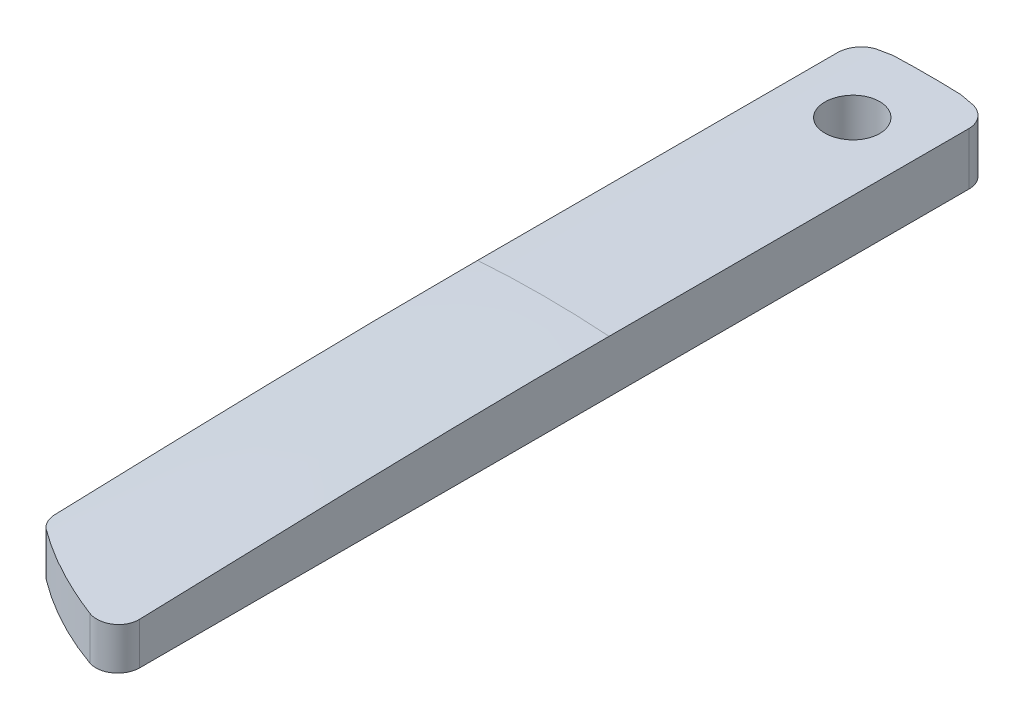
ISO-10303-21;
HEADER;
FILE_DESCRIPTION(('STEP AP214'),'2;1');
FILE_NAME('part.step','',(''),(''),'','','');
FILE_SCHEMA(('AUTOMOTIVE_DESIGN { 1 0 10303 214 1 1 1 1 }'));
ENDSEC;
DATA;
#1=APPLICATION_CONTEXT('core data for automotive mechanical design processes');
#2=APPLICATION_PROTOCOL_DEFINITION('international standard','automotive_design',2000,#1);
#3=PRODUCT_CONTEXT('',#1,'mechanical');
#4=PRODUCT('Part','Part','',(#3));
#5=PRODUCT_RELATED_PRODUCT_CATEGORY('part','',(#4));
#6=PRODUCT_DEFINITION_FORMATION('','',#4);
#7=PRODUCT_DEFINITION_CONTEXT('part definition',#1,'design');
#8=PRODUCT_DEFINITION('design','',#6,#7);
#9=PRODUCT_DEFINITION_SHAPE('','',#8);
#10=(LENGTH_UNIT() NAMED_UNIT(*) SI_UNIT(.MILLI.,.METRE.));
#11=(NAMED_UNIT(*) PLANE_ANGLE_UNIT() SI_UNIT($,.RADIAN.));
#12=(NAMED_UNIT(*) SI_UNIT($,.STERADIAN.) SOLID_ANGLE_UNIT());
#13=UNCERTAINTY_MEASURE_WITH_UNIT(LENGTH_MEASURE(1.E-05),#10,'distance_accuracy_value','');
#14=(GEOMETRIC_REPRESENTATION_CONTEXT(3) GLOBAL_UNCERTAINTY_ASSIGNED_CONTEXT((#13)) GLOBAL_UNIT_ASSIGNED_CONTEXT((#10,
#11,#12)) REPRESENTATION_CONTEXT('',''));
#15=CARTESIAN_POINT('',(0.,0.,0.));
#16=DIRECTION('',(0.,0.,1.));
#17=DIRECTION('',(1.,0.,0.));
#18=AXIS2_PLACEMENT_3D('',#15,#16,#17);
#19=CARTESIAN_POINT('',(13.9928553197694,-2.5,24.7449671614379));
#20=DIRECTION('',(0.,-1.,0.));
#21=DIRECTION('',(0.,0.,-1.));
#22=AXIS2_PLACEMENT_3D('',#19,#20,#21);
#23=PLANE('',#22);
#24=CARTESIAN_POINT('',(0.,-2.5,-18.));
#25=DIRECTION('',(0.,1.,0.));
#26=DIRECTION('',(0.,0.,1.));
#27=AXIS2_PLACEMENT_3D('',#24,#25,#26);
#28=CIRCLE('',#27,2.5);
#29=CARTESIAN_POINT('',(0.,-2.5,-15.5));
#30=VERTEX_POINT('',#29);
#31=EDGE_CURVE('E404',#30,#30,#28,.T.);
#32=ORIENTED_EDGE('',*,*,#31,.T.);
#33=EDGE_LOOP('',(#32));
#34=FACE_BOUND('',#33,.T.);
#35=CARTESIAN_POINT('',(0.,-2.5,0.));
#36=DIRECTION('',(0.,1.,0.));
#37=DIRECTION('',(0.,0.,-1.));
#38=AXIS2_PLACEMENT_3D('',#35,#36,#37);
#39=CIRCLE('',#38,25.);
#40=CARTESIAN_POINT('',(-3.08027292062684,-2.5,-24.8095126662023));
#41=VERTEX_POINT('',#40);
#42=CARTESIAN_POINT('',(-4.34782608695653,-2.5,-24.6190253324046));
#43=VERTEX_POINT('',#42);
#44=EDGE_CURVE('E140',#41,#43,#39,.T.);
#45=ORIENTED_EDGE('',*,*,#44,.F.);
#46=DIRECTION('',(1.,0.,0.));
#47=VECTOR('',#46,1.);
#48=CARTESIAN_POINT('',(13.9928553197694,-2.5,-24.8095126662023));
#49=LINE('',#48,#47);
#50=CARTESIAN_POINT('',(3.08027292062684,-2.5,-24.8095126662023));
#51=VERTEX_POINT('',#50);
#52=EDGE_CURVE('E337',#41,#51,#49,.T.);
#53=ORIENTED_EDGE('',*,*,#52,.T.);
#54=CARTESIAN_POINT('',(4.34782608695653,-2.5,-24.6190253324046));
#55=VERTEX_POINT('',#54);
#56=EDGE_CURVE('E378',#55,#51,#39,.T.);
#57=ORIENTED_EDGE('',*,*,#56,.F.);
#58=CARTESIAN_POINT('',(4.00000000000001,-2.5,-22.6495033058122));
#59=DIRECTION('',(0.,-1.,0.));
#60=DIRECTION('',(0.,0.,-1.));
#61=AXIS2_PLACEMENT_3D('',#58,#59,#60);
#62=CIRCLE('',#61,2.);
#63=CARTESIAN_POINT('',(6.00000000000001,-2.5,-22.6495033058122));
#64=VERTEX_POINT('',#63);
#65=EDGE_CURVE('E376',#55,#64,#62,.T.);
#66=ORIENTED_EDGE('',*,*,#65,.T.);
#67=DIRECTION('',(0.,0.,-1.));
#68=VECTOR('',#67,1.);
#69=CARTESIAN_POINT('',(6.00000000000001,-2.5,-24.2693221990232));
#70=LINE('',#69,#68);
#71=CARTESIAN_POINT('',(6.00000000000002,-2.5,53.0317634197305));
#72=VERTEX_POINT('',#71);
#73=EDGE_CURVE('E369',#72,#64,#70,.T.);
#74=ORIENTED_EDGE('',*,*,#73,.F.);
#75=CARTESIAN_POINT('',(4.00000000000001,-2.5,53.0317634197305));
#76=DIRECTION('',(0.,-1.,0.));
#77=DIRECTION('',(0.,0.,-1.));
#78=AXIS2_PLACEMENT_3D('',#75,#76,#77);
#79=CIRCLE('',#78,2.);
#80=CARTESIAN_POINT('',(3.33380964534872,-2.5,54.91754983695));
#81=VERTEX_POINT('',#80);
#82=EDGE_CURVE('E389',#72,#81,#79,.T.);
#83=ORIENTED_EDGE('',*,*,#82,.T.);
#84=CARTESIAN_POINT('',(13.9928553197694,-2.5,24.7449671614379));
#85=DIRECTION('',(0.,1.,0.));
#86=DIRECTION('',(0.,0.,-1.));
#87=AXIS2_PLACEMENT_3D('',#84,#85,#86);
#88=CIRCLE('',#87,32.);
#89=CARTESIAN_POINT('',(-5.19952368798464,-2.5,50.3506811335716));
#90=VERTEX_POINT('',#89);
#91=EDGE_CURVE('E399',#90,#81,#88,.T.);
#92=ORIENTED_EDGE('',*,*,#91,.F.);
#93=CARTESIAN_POINT('',(-4.00000000000001,-2.5,48.7503240103132));
#94=DIRECTION('',(0.,-1.,0.));
#95=DIRECTION('',(0.,0.,-1.));
#96=AXIS2_PLACEMENT_3D('',#93,#94,#95);
#97=CIRCLE('',#96,2.);
#98=CARTESIAN_POINT('',(-6.00000000000001,-2.5,48.7503240103132));
#99=VERTEX_POINT('',#98);
#100=EDGE_CURVE('E386',#90,#99,#97,.T.);
#101=ORIENTED_EDGE('',*,*,#100,.T.);
#102=DIRECTION('',(0.,0.,1.));
#103=VECTOR('',#102,1.);
#104=CARTESIAN_POINT('',(-6.00000000000001,-2.5,49.7306778009768));
#105=LINE('',#104,#103);
#106=CARTESIAN_POINT('',(-6.00000000000001,-2.5,-22.6495033058122));
#107=VERTEX_POINT('',#106);
#108=EDGE_CURVE('E372',#107,#99,#105,.T.);
#109=ORIENTED_EDGE('',*,*,#108,.F.);
#110=CARTESIAN_POINT('',(-4.00000000000001,-2.5,-22.6495033058122));
#111=DIRECTION('',(0.,-1.,0.));
#112=DIRECTION('',(0.,0.,-1.));
#113=AXIS2_PLACEMENT_3D('',#110,#111,#112);
#114=CIRCLE('',#113,2.);
#115=EDGE_CURVE('E342',#107,#43,#114,.T.);
#116=ORIENTED_EDGE('',*,*,#115,.T.);
#117=EDGE_LOOP('',(#45,#53,#57,#66,#74,#83,#92,#101,#109,#116));
#118=FACE_BOUND('',#117,.T.);
#119=ADVANCED_FACE('F115',(#34,#118),#23,.T.);
#120=CARTESIAN_POINT('',(13.9928553197694,2.5,24.7449671614379));
#121=DIRECTION('',(0.,-1.,0.));
#122=DIRECTION('',(0.,0.,-1.));
#123=AXIS2_PLACEMENT_3D('',#120,#121,#122);
#124=CYLINDRICAL_SURFACE('',#123,32.);
#125=CARTESIAN_POINT('',(-5.19952368798462,1.48592776477285,50.3506811335716));
#126=CARTESIAN_POINT('',(-4.98227051781722,1.49420419211207,50.5135210941134));
#127=CARTESIAN_POINT('',(-4.76292823961869,1.50185639134832,50.6736064220553));
#128=CARTESIAN_POINT('',(-4.32095768664768,1.51579098201104,50.9876323832612));
#129=CARTESIAN_POINT('',(-4.09834297108921,1.52207790122318,51.141591900073));
#130=CARTESIAN_POINT('',(-3.649861191794,1.53320258146359,51.4434206638506));
#131=CARTESIAN_POINT('',(-3.42400455101821,1.53804421534596,51.5913052543202));
#132=CARTESIAN_POINT('',(-2.96906614109376,1.54619966728101,51.8810280006863));
#133=CARTESIAN_POINT('',(-2.73999189077253,1.54951658179831,52.022877875401));
#134=CARTESIAN_POINT('',(-2.2786378228024,1.55454363433481,52.3005637034983));
#135=CARTESIAN_POINT('',(-2.04636283920938,1.55625597261258,52.4364076480232));
#136=CARTESIAN_POINT('',(-1.57861969865163,1.55799450810096,52.7021032683411));
#137=CARTESIAN_POINT('',(-1.34315389648187,1.55802188752692,52.831959081654));
#138=CARTESIAN_POINT('',(-0.869015475376385,1.55631031749254,53.0856993032242));
#139=CARTESIAN_POINT('',(-0.630342674966581,1.55457126765654,53.2095833717238));
#140=CARTESIAN_POINT('',(-0.149804906372357,1.54924542676444,53.4513698405769));
#141=CARTESIAN_POINT('',(0.0920621032840678,1.54565739216592,53.5692681564908));
#142=CARTESIAN_POINT('',(0.578992188593072,1.5365510570891,53.7990692953596));
#143=CARTESIAN_POINT('',(0.824059144358763,1.53103015258742,53.9109637940654));
#144=CARTESIAN_POINT('',(1.3173982733493,1.51797415891296,54.1287320632589));
#145=CARTESIAN_POINT('',(1.56567596298336,1.51043498591371,54.2345930927424));
#146=CARTESIAN_POINT('',(2.06545131683964,1.49325638977009,54.4402571286103));
#147=CARTESIAN_POINT('',(2.31695593097059,1.48361127833727,54.5400427728287));
#148=CARTESIAN_POINT('',(2.82320454402427,1.46213410990519,54.733508358399));
#149=CARTESIAN_POINT('',(3.07795671591359,1.45029463595169,54.8271660896906));
#150=CARTESIAN_POINT('',(3.33380964534873,1.43734147897503,54.91754983695));
#151=B_SPLINE_CURVE_WITH_KNOTS('',3,(#125,#126,#127,#128,#129,#130,#131,#132,#133,#134,#135,
#136,#137,#138,#139,#140,#141,#142,#143,#144,#145,#146,#147,#148,#149,#150),.UNSPECIFIED.,.F.,
.F.,(4,2,2,2,2,2,2,2,2,2,2,2,4),(0.,0.814875929795815,1.62700669287661,2.43694128340289,
3.24522367757474,4.0523960939944,4.85900216868354,5.6656540805538,6.47284921896487,
7.2811360477051,8.09107091533176,8.90322115111113,9.71816824681233),.UNSPECIFIED.);
#152=CARTESIAN_POINT('',(-5.19952368798462,1.48592776477285,50.3506811335716));
#153=VERTEX_POINT('',#152);
#154=CARTESIAN_POINT('',(3.33380964534872,1.43734147897503,54.91754983695));
#155=VERTEX_POINT('',#154);
#156=EDGE_CURVE('E228',#153,#155,#151,.T.);
#157=ORIENTED_EDGE('',*,*,#156,.F.);
#158=DIRECTION('',(0.,-1.,0.));
#159=VECTOR('',#158,1.);
#160=CARTESIAN_POINT('',(-5.19952368798464,2.5,50.3506811335716));
#161=LINE('',#160,#159);
#162=EDGE_CURVE('E352',#153,#90,#161,.T.);
#163=ORIENTED_EDGE('',*,*,#162,.T.);
#164=ORIENTED_EDGE('',*,*,#91,.T.);
#165=DIRECTION('',(0.,-1.,0.));
#166=VECTOR('',#165,1.);
#167=CARTESIAN_POINT('',(3.33380964534872,2.5,54.91754983695));
#168=LINE('',#167,#166);
#169=EDGE_CURVE('E345',#81,#155,#168,.F.);
#170=ORIENTED_EDGE('',*,*,#169,.T.);
#171=EDGE_LOOP('',(#157,#163,#164,#170));
#172=FACE_BOUND('',#171,.T.);
#173=ADVANCED_FACE('F397',(#172),#124,.T.);
#174=CARTESIAN_POINT('',(6.00000000000001,2.5,-24.2693221990232));
#175=DIRECTION('',(-1.,0.,0.));
#176=DIRECTION('',(0.,0.,1.));
#177=AXIS2_PLACEMENT_3D('',#174,#175,#176);
#178=PLANE('',#177);
#179=DIRECTION('',(0.,0.,-1.));
#180=VECTOR('',#179,1.);
#181=CARTESIAN_POINT('',(6.00000000000002,2.28797084492587,77.3564966406965));
#182=LINE('',#181,#180);
#183=CARTESIAN_POINT('',(6.00000000000001,2.28797084492587,10.1904873337977));
#184=VERTEX_POINT('',#183);
#185=CARTESIAN_POINT('',(6.00000000000001,2.28797084492587,-22.6495033058122));
#186=VERTEX_POINT('',#185);
#187=EDGE_CURVE('E132',#184,#186,#182,.T.);
#188=ORIENTED_EDGE('',*,*,#187,.F.);
#189=CARTESIAN_POINT('',(6.00000000000002,1.3477578727449,53.0317634197305));
#190=CARTESIAN_POINT('',(6.00000000000002,1.40900490410655,51.0802190646011));
#191=CARTESIAN_POINT('',(6.00000000000002,1.47149210443265,49.1287131995284));
#192=CARTESIAN_POINT('',(6.00000000000001,1.59577490113629,45.2256392920489));
#193=CARTESIAN_POINT('',(6.00000000000001,1.65757048320436,43.2740712491903));
#194=CARTESIAN_POINT('',(6.00000000000001,1.7772955082444,39.370807952014));
#195=CARTESIAN_POINT('',(6.00000000000001,1.83522493839082,37.4191126972956));
#196=CARTESIAN_POINT('',(6.00000000000001,1.94404164442152,33.5155505512585));
#197=CARTESIAN_POINT('',(6.00000000000001,1.99492902437227,31.5636836629027));
#198=CARTESIAN_POINT('',(6.00000000000001,2.07885573629368,27.9936038691958));
#199=CARTESIAN_POINT('',(6.00000000000001,2.1134591097672,26.3754281885269));
#200=CARTESIAN_POINT('',(6.00000000000001,2.17429199556667,23.1389213554166));
#201=CARTESIAN_POINT('',(6.00000000000001,2.20052152986356,21.5205902033942));
#202=CARTESIAN_POINT('',(6.00000000000001,2.24328988823328,18.2836780170968));
#203=CARTESIAN_POINT('',(6.00000000000001,2.25982800161605,16.6650969732003));
#204=CARTESIAN_POINT('',(6.00000000000001,2.28219025088088,13.4278421537915));
#205=CARTESIAN_POINT('',(6.00000000000001,2.28801425539474,11.8091683773856));
#206=CARTESIAN_POINT('',(6.00000000000001,2.28797084492587,10.1904873337977));
#207=B_SPLINE_CURVE_WITH_KNOTS('',3,(#189,#190,#191,#192,#193,#194,#195,#196,#197,#198,#199,
#200,#201,#202,#203,#204,#205,#206),.UNSPECIFIED.,.F.,.F.,(4,2,2,2,2,2,2,2,4),(0.,
5.85751692583066,11.7151548194537,17.5728121442129,23.4303828960557,28.2860018463583,
33.1416080565867,37.9975702929786,42.8535920690688),.UNSPECIFIED.);
#208=CARTESIAN_POINT('',(6.00000000000001,1.3477578727449,53.0317634197305));
#209=VERTEX_POINT('',#208);
#210=EDGE_CURVE('E217',#209,#184,#207,.T.);
#211=ORIENTED_EDGE('',*,*,#210,.F.);
#212=DIRECTION('',(0.,-1.,0.));
#213=VECTOR('',#212,1.);
#214=CARTESIAN_POINT('',(6.00000000000002,2.5,53.0317634197305));
#215=LINE('',#214,#213);
#216=EDGE_CURVE('E371',#209,#72,#215,.T.);
#217=ORIENTED_EDGE('',*,*,#216,.T.);
#218=ORIENTED_EDGE('',*,*,#73,.T.);
#219=DIRECTION('',(0.,-1.,0.));
#220=VECTOR('',#219,1.);
#221=CARTESIAN_POINT('',(6.00000000000001,2.5,-22.6495033058122));
#222=LINE('',#221,#220);
#223=EDGE_CURVE('E364',#64,#186,#222,.F.);
#224=ORIENTED_EDGE('',*,*,#223,.T.);
#225=EDGE_LOOP('',(#188,#211,#217,#218,#224));
#226=FACE_BOUND('',#225,.T.);
#227=ADVANCED_FACE('F292',(#226),#178,.F.);
#228=CARTESIAN_POINT('',(0.,2.5,0.));
#229=DIRECTION('',(0.,-1.,0.));
#230=DIRECTION('',(0.,0.,-1.));
#231=AXIS2_PLACEMENT_3D('',#228,#229,#230);
#232=CYLINDRICAL_SURFACE('',#231,25.);
#233=DIRECTION('',(0.,-1.,0.));
#234=VECTOR('',#233,1.);
#235=CARTESIAN_POINT('',(3.08027292062684,2.5,-24.8095126662023));
#236=LINE('',#235,#234);
#237=CARTESIAN_POINT('',(3.08027292062691,2.44416942165279,-24.8095126662023));
#238=VERTEX_POINT('',#237);
#239=EDGE_CURVE('E51',#238,#51,#236,.T.);
#240=ORIENTED_EDGE('',*,*,#239,.F.);
#241=CARTESIAN_POINT('',(4.34782608695652,2.38872957181996,-24.6190253324046));
#242=CARTESIAN_POINT('',(4.1374471613898,2.39951078603454,-24.6561799795087));
#243=CARTESIAN_POINT('',(3.92662826807895,2.4095213806279,-24.6906312475438));
#244=CARTESIAN_POINT('',(3.50411054596908,2.42800133057218,-24.7541270254764));
#245=CARTESIAN_POINT('',(3.29241171717006,2.4364706859231,-24.7831715353738));
#246=CARTESIAN_POINT('',(3.08027292062691,2.4441694216528,-24.8095126662023));
#247=B_SPLINE_CURVE_WITH_KNOTS('',3,(#241,#242,#243,#244,#245,#246),.UNSPECIFIED.,.F.,.F.,(4,2,
4),(0.,0.64154919441254,1.28309838882483),.UNSPECIFIED.);
#248=CARTESIAN_POINT('',(4.34782608695653,2.38872957181996,-24.6190253324046));
#249=VERTEX_POINT('',#248);
#250=EDGE_CURVE('E219',#249,#238,#247,.T.);
#251=ORIENTED_EDGE('',*,*,#250,.F.);
#252=DIRECTION('',(0.,-1.,0.));
#253=VECTOR('',#252,1.);
#254=CARTESIAN_POINT('',(4.34782608695653,2.5,-24.6190253324046));
#255=LINE('',#254,#253);
#256=EDGE_CURVE('E349',#249,#55,#255,.T.);
#257=ORIENTED_EDGE('',*,*,#256,.T.);
#258=ORIENTED_EDGE('',*,*,#56,.T.);
#259=EDGE_LOOP('',(#240,#251,#257,#258));
#260=FACE_BOUND('',#259,.T.);
#261=ADVANCED_FACE('F287',(#260),#232,.T.);
#262=DIRECTION('',(0.,-1.,0.));
#263=VECTOR('',#262,1.);
#264=CARTESIAN_POINT('',(-3.08027292062684,2.5,-24.8095126662023));
#265=LINE('',#264,#263);
#266=CARTESIAN_POINT('',(-3.08027292062691,2.44416942165279,-24.8095126662023));
#267=VERTEX_POINT('',#266);
#268=EDGE_CURVE('E125',#41,#267,#265,.F.);
#269=ORIENTED_EDGE('',*,*,#268,.F.);
#270=ORIENTED_EDGE('',*,*,#44,.T.);
#271=DIRECTION('',(0.,-1.,0.));
#272=VECTOR('',#271,1.);
#273=CARTESIAN_POINT('',(-4.34782608695653,2.5,-24.6190253324046));
#274=LINE('',#273,#272);
#275=CARTESIAN_POINT('',(-4.34782608695653,2.38872957181996,-24.6190253324046));
#276=VERTEX_POINT('',#275);
#277=EDGE_CURVE('E339',#43,#276,#274,.F.);
#278=ORIENTED_EDGE('',*,*,#277,.T.);
#279=CARTESIAN_POINT('',(-3.08027292062691,2.44416942165279,-24.8095126662023));
#280=CARTESIAN_POINT('',(-3.29241171717006,2.43647068592309,-24.7831715353738));
#281=CARTESIAN_POINT('',(-3.50411054596909,2.42800133057217,-24.7541270254764));
#282=CARTESIAN_POINT('',(-3.92662826807896,2.40952138062789,-24.6906312475438));
#283=CARTESIAN_POINT('',(-4.13744716138981,2.39951078603453,-24.6561799795087));
#284=CARTESIAN_POINT('',(-4.34782608695652,2.38872957181995,-24.6190253324046));
#285=B_SPLINE_CURVE_WITH_KNOTS('',3,(#279,#280,#281,#282,#283,#284),.UNSPECIFIED.,.F.,.F.,(4,2,
4),(0.,0.641549194412296,1.28309838882484),.UNSPECIFIED.);
#286=EDGE_CURVE('E210',#267,#276,#285,.T.);
#287=ORIENTED_EDGE('',*,*,#286,.F.);
#288=EDGE_LOOP('',(#269,#270,#278,#287));
#289=FACE_BOUND('',#288,.T.);
#290=ADVANCED_FACE('F291',(#289),#232,.T.);
#291=CARTESIAN_POINT('',(-6.00000000000001,2.5,49.7306778009768));
#292=DIRECTION('',(1.,0.,0.));
#293=DIRECTION('',(0.,0.,-1.));
#294=AXIS2_PLACEMENT_3D('',#291,#292,#293);
#295=PLANE('',#294);
#296=DIRECTION('',(0.,0.,-1.));
#297=VECTOR('',#296,1.);
#298=CARTESIAN_POINT('',(-6.00000000000002,2.28797084492587,77.3564966406965));
#299=LINE('',#298,#297);
#300=CARTESIAN_POINT('',(-6.00000000000001,2.28797084492587,-22.6495033058122));
#301=VERTEX_POINT('',#300);
#302=CARTESIAN_POINT('',(-6.00000000000001,2.28797084492587,10.1904873337977));
#303=VERTEX_POINT('',#302);
#304=EDGE_CURVE('E199',#301,#303,#299,.F.);
#305=ORIENTED_EDGE('',*,*,#304,.F.);
#306=DIRECTION('',(0.,-1.,0.));
#307=VECTOR('',#306,1.);
#308=CARTESIAN_POINT('',(-6.00000000000001,2.5,-22.6495033058122));
#309=LINE('',#308,#307);
#310=EDGE_CURVE('E341',#301,#107,#309,.T.);
#311=ORIENTED_EDGE('',*,*,#310,.T.);
#312=ORIENTED_EDGE('',*,*,#108,.T.);
#313=DIRECTION('',(0.,-1.,0.));
#314=VECTOR('',#313,1.);
#315=CARTESIAN_POINT('',(-6.00000000000001,2.5,48.7503240103132));
#316=LINE('',#315,#314);
#317=CARTESIAN_POINT('',(-6.,1.48350172448284,48.7503240103132));
#318=VERTEX_POINT('',#317);
#319=EDGE_CURVE('E226',#99,#318,#316,.F.);
#320=ORIENTED_EDGE('',*,*,#319,.T.);
#321=CARTESIAN_POINT('',(-6.,2.28797084492587,10.1904873337977));
#322=CARTESIAN_POINT('',(-6.,2.28797507351094,11.166812280221));
#323=CARTESIAN_POINT('',(-6.00000000000001,2.28586672477483,12.1431356056413));
#324=CARTESIAN_POINT('',(-6.00000000000001,2.27761711552835,14.0957628937102));
#325=CARTESIAN_POINT('',(-6.00000000000002,2.27147586516508,15.0720668564012));
#326=CARTESIAN_POINT('',(-6.,2.24729170059607,18.0008611045771));
#327=CARTESIAN_POINT('',(-5.99999999999995,2.22348834494228,19.9533055389628));
#328=CARTESIAN_POINT('',(-5.99999999999994,2.16252073050069,23.8579593132316));
#329=CARTESIAN_POINT('',(-5.99999999999999,2.1253565998791,25.8101686551901));
#330=CARTESIAN_POINT('',(-6.00000000000003,2.04015728162102,29.7143803189646));
#331=CARTESIAN_POINT('',(-6.00000000000004,1.99212190437696,31.6663826365757));
#332=CARTESIAN_POINT('',(-6.00000000000003,1.87282820793208,36.1405828379366));
#333=CARTESIAN_POINT('',(-6.00000000000002,1.79888562610699,38.6627070753375));
#334=CARTESIAN_POINT('',(-6.,1.64442483175734,43.7066671755156));
#335=CARTESIAN_POINT('',(-5.99999999999999,1.56390685368271,46.228503045367));
#336=CARTESIAN_POINT('',(-5.99999999999997,1.48350172448284,48.7503240103132));
#337=B_SPLINE_CURVE_WITH_KNOTS('',3,(#321,#322,#323,#324,#325,#326,#327,#328,#329,#330,#331,
#332,#333,#334,#335,#336),.UNSPECIFIED.,.F.,.F.,(4,2,2,2,2,2,2,4),(0.,2.92896976753949,
5.85793216558603,11.715641601686,17.5732948479066,23.4310502664986,31.0006593767229,
38.5699987054566),.UNSPECIFIED.);
#338=EDGE_CURVE('E214',#303,#318,#337,.T.);
#339=ORIENTED_EDGE('',*,*,#338,.F.);
#340=EDGE_LOOP('',(#305,#311,#312,#320,#339));
#341=FACE_BOUND('',#340,.T.);
#342=ADVANCED_FACE('F223',(#341),#295,.F.);
#343=CARTESIAN_POINT('',(0.,2.5,-18.));
#344=DIRECTION('',(0.,-1.,0.));
#345=DIRECTION('',(0.,0.,-1.));
#346=AXIS2_PLACEMENT_3D('',#343,#344,#345);
#347=CYLINDRICAL_SURFACE('',#346,2.5);
#348=ORIENTED_EDGE('',*,*,#31,.F.);
#349=EDGE_LOOP('',(#348));
#350=FACE_BOUND('',#349,.T.);
#351=CARTESIAN_POINT('',(0.,2.5,-20.5));
#352=CARTESIAN_POINT('',(-0.140393524378718,2.4999995046087,-20.4999937841003));
#353=CARTESIAN_POINT('',(-0.280888074295992,2.49964843891319,-20.4881340996054));
#354=CARTESIAN_POINT('',(-0.558005647093424,2.49828171748725,-20.4409892913322));
#355=CARTESIAN_POINT('',(-0.694623840406101,2.4972652676845,-20.4056761773938));
#356=CARTESIAN_POINT('',(-0.95993400401729,2.49468288969539,-20.3126326671837));
#357=CARTESIAN_POINT('',(-1.08862981263495,2.49311723009836,-20.254913227187));
#358=CARTESIAN_POINT('',(-1.33446931951485,2.48961304149571,-20.1187111960275));
#359=CARTESIAN_POINT('',(-1.45161583025469,2.48767460360977,-20.0402336770882));
#360=CARTESIAN_POINT('',(-1.67111944140127,2.48364216613613,-19.8647022282896));
#361=CARTESIAN_POINT('',(-1.7734709848132,2.48154810854245,-19.7676413501677));
#362=CARTESIAN_POINT('',(-1.96043256823564,2.47744095729957,-19.5577103991347));
#363=CARTESIAN_POINT('',(-2.04504190204469,2.47542786687572,-19.444839697236));
#364=CARTESIAN_POINT('',(-2.19412564280933,2.47170938036892,-19.2064729073285));
#365=CARTESIAN_POINT('',(-2.25859676954662,2.47000403443212,-19.0809747668924));
#366=CARTESIAN_POINT('',(-2.3655526214457,2.46709386485658,-18.820930175471));
#367=CARTESIAN_POINT('',(-2.40803743309319,2.46588903924899,-18.6863837600806));
#368=CARTESIAN_POINT('',(-2.46980287379754,2.46411618035475,-18.4121033550716));
#369=CARTESIAN_POINT('',(-2.48909025786777,2.46354796169358,-18.2723708878379));
#370=CARTESIAN_POINT('',(-2.50393415065727,2.46311182801535,-17.9916504292447));
#371=CARTESIAN_POINT('',(-2.4994907520903,2.46324391026228,-17.8506624427926));
#372=CARTESIAN_POINT('',(-2.46700493241114,2.46419331109802,-17.5714789086865));
#373=CARTESIAN_POINT('',(-2.43896981673904,2.46501041756108,-17.43328251015));
#374=CARTESIAN_POINT('',(-2.36010767528186,2.46723742037347,-17.1635584733523));
#375=CARTESIAN_POINT('',(-2.30928060033578,2.4686473180014,-17.032030849476));
#376=CARTESIAN_POINT('',(-2.18626895522428,2.47190121055802,-16.7793544758949));
#377=CARTESIAN_POINT('',(-2.11408103649144,2.47374527353804,-16.658207357301));
#378=CARTESIAN_POINT('',(-1.95039935241673,2.47765954321457,-16.4297488298107));
#379=CARTESIAN_POINT('',(-1.85890554498097,2.47972975040414,-16.3224374510822));
#380=CARTESIAN_POINT('',(-1.65916792957406,2.48386387779281,-16.1246540178099));
#381=CARTESIAN_POINT('',(-1.55091778578673,2.48592779531143,-16.0341883615028));
#382=CARTESIAN_POINT('',(-1.32076268672099,2.4898159191187,-15.872713635295));
#383=CARTESIAN_POINT('',(-1.19885772924849,2.49164012536884,-15.8017045685205));
#384=CARTESIAN_POINT('',(-0.944849909762427,2.49484321244865,-15.6811594407829));
#385=CARTESIAN_POINT('',(-0.812746952496885,2.4962220891182,-15.6316235804136));
#386=CARTESIAN_POINT('',(-0.542094676929893,2.49837901386233,-15.5554350986089));
#387=CARTESIAN_POINT('',(-0.403545375506729,2.49915706350996,-15.5287824172627));
#388=CARTESIAN_POINT('',(-0.123988938954879,2.50002442732397,-15.4991247085231));
#389=CARTESIAN_POINT('',(0.0170172562401733,2.50011399932433,-15.4961108284216));
#390=CARTESIAN_POINT('',(0.297533629735388,2.49959499378029,-15.5137932065561));
#391=CARTESIAN_POINT('',(0.437043809699056,2.49898641701229,-15.5344894384247));
#392=CARTESIAN_POINT('',(0.710583265267391,2.49713986854047,-15.5989972206533));
#393=CARTESIAN_POINT('',(0.844613489435591,2.49590200626664,-15.6428047521094));
#394=CARTESIAN_POINT('',(1.10341750203545,2.49293637808399,-15.7522875119779));
#395=CARTESIAN_POINT('',(1.22819127264489,2.49120861123193,-15.8179627824926));
#396=CARTESIAN_POINT('',(1.46498123802067,2.48745717315988,-15.9693395272444));
#397=CARTESIAN_POINT('',(1.5769936224216,2.48543341397063,-16.0550469596066));
#398=CARTESIAN_POINT('',(1.7850429177898,2.48131836506353,-16.2440463538795));
#399=CARTESIAN_POINT('',(1.88107978927006,2.47922707517876,-16.3473383592531));
#400=CARTESIAN_POINT('',(2.05448146308617,2.47521198907129,-16.5686127386144));
#401=CARTESIAN_POINT('',(2.13184055281937,2.47328824420698,-16.6865995903403));
#402=CARTESIAN_POINT('',(2.26565165005375,2.46982595095152,-16.9338915683921));
#403=CARTESIAN_POINT('',(2.32210370368156,2.46828740171053,-17.0631966697462));
#404=CARTESIAN_POINT('',(2.41248825841416,2.46576933485917,-17.3294331323827));
#405=CARTESIAN_POINT('',(2.446424457618,2.46478972544987,-17.4663632372958));
#406=CARTESIAN_POINT('',(2.49082610452918,2.46349972900635,-17.7439805801934));
#407=CARTESIAN_POINT('',(2.50129157044439,2.46318934145297,-17.8846678152633));
#408=CARTESIAN_POINT('',(2.49845424187916,2.46327281736618,-18.1657486001041));
#409=CARTESIAN_POINT('',(2.4851604596561,2.4636664138006,-18.3061422410174));
#410=CARTESIAN_POINT('',(2.4352005252155,2.46511292567584,-18.582704077844));
#411=CARTESIAN_POINT('',(2.39853432663588,2.46616584242451,-18.7188722653749));
#412=CARTESIAN_POINT('',(2.30287157861963,2.46881225953516,-18.9831214226391));
#413=CARTESIAN_POINT('',(2.24387465356549,2.4704057689902,-19.1112022562955));
#414=CARTESIAN_POINT('',(2.10522837096703,2.47395366349274,-19.3556384118559));
#415=CARTESIAN_POINT('',(2.02557976276147,2.47590803544572,-19.4719941589876));
#416=CARTESIAN_POINT('',(1.84786492977961,2.47995807750223,-19.6897183857987));
#417=CARTESIAN_POINT('',(1.74979368738696,2.48205378600048,-19.7910827689327));
#418=CARTESIAN_POINT('',(1.53799721863,2.48615039038899,-19.9759360733266));
#419=CARTESIAN_POINT('',(1.42426812157842,2.48815126267041,-20.0594205615197));
#420=CARTESIAN_POINT('',(1.18434076631098,2.49183332276256,-20.2061579091563));
#421=CARTESIAN_POINT('',(1.05813455489749,2.49351430464529,-20.2693977539498));
#422=CARTESIAN_POINT('',(0.79698863765337,2.49636338844887,-20.3737173662836));
#423=CARTESIAN_POINT('',(0.662059564889552,2.49753210177965,-20.41482356455));
#424=CARTESIAN_POINT('',(0.438564897759313,2.49891253358713,-20.4628131108167));
#425=CARTESIAN_POINT('',(0.351450023475592,2.49931856455643,-20.4767406530866));
#426=CARTESIAN_POINT('',(0.176236704864157,2.49986245322686,-20.4953360475219));
#427=CARTESIAN_POINT('',(0.0881382608146911,2.50000031100386,-20.5000039023067));
#428=CARTESIAN_POINT('',(0.,2.5,-20.5));
#429=B_SPLINE_CURVE_WITH_KNOTS('',3,(#351,#352,#353,#354,#355,#356,#357,#358,#359,#360,#361,
#362,#363,#364,#365,#366,#367,#368,#369,#370,#371,#372,#373,#374,#375,#376,#377,#378,#379,#380,
#381,#382,#383,#384,#385,#386,#387,#388,#389,#390,#391,#392,#393,#394,#395,#396,#397,#398,#399,
#400,#401,#402,#403,#404,#405,#406,#407,#408,#409,#410,#411,#412,#413,#414,#415,#416,#417,#418,
#419,#420,#421,#422,#423,#424,#425,#426,#427,#428),.UNSPECIFIED.,.T.,.F.,(4,2,2,2,2,2,2,2,2,2,2,
2,2,2,2,2,2,2,2,2,2,2,2,2,2,2,2,2,2,2,2,2,2,2,2,2,2,2,4),(0.,0.420858857472668,
0.842220887644196,1.26337713865912,1.68443057532394,2.10564175114649,2.52686968945313,
2.94816620387193,3.36946106106012,3.79063320886891,4.21180371120218,4.63284384133271,
5.05388487962772,5.47499195613254,5.89609995081405,6.31736756330548,6.7386352434875,
7.15990685889558,7.58117737136181,8.00229011089399,8.42340238211803,8.8444414488,
9.26548132612255,9.68664659219761,10.1078128992605,10.529107857394,10.9504018860301,
11.3716267024146,11.792851192026,12.2139159384569,12.6349815201246,13.0560541847072,
13.4771115729601,13.8982838077482,14.3195603456484,14.7411071677547,15.1621494802117,
15.426362366124,15.6905751772936),.UNSPECIFIED.);
#430=CARTESIAN_POINT('',(0.,2.5,-20.5));
#431=VERTEX_POINT('',#430);
#432=EDGE_CURVE('E229',#431,#431,#429,.T.);
#433=ORIENTED_EDGE('',*,*,#432,.T.);
#434=EDGE_LOOP('',(#433));
#435=FACE_BOUND('',#434,.T.);
#436=ADVANCED_FACE('F265',(#350,#435),#347,.F.);
#437=CARTESIAN_POINT('',(4.00000000000001,2.5,53.0317634197305));
#438=DIRECTION('',(0.,-1.,0.));
#439=DIRECTION('',(0.,0.,-1.));
#440=AXIS2_PLACEMENT_3D('',#437,#438,#439);
#441=CYLINDRICAL_SURFACE('',#440,2.);
#442=ORIENTED_EDGE('',*,*,#169,.F.);
#443=ORIENTED_EDGE('',*,*,#82,.F.);
#444=ORIENTED_EDGE('',*,*,#216,.F.);
#445=CARTESIAN_POINT('',(6.00000000000001,1.3477578727449,53.0317634197305));
#446=CARTESIAN_POINT('',(5.999999686585,1.34599614550849,53.0878664103495));
#447=CARTESIAN_POINT('',(5.99763784221396,1.34440575725035,53.1439480470526));
#448=CARTESIAN_POINT('',(5.98821316547493,1.34157429289668,53.2557212387371));
#449=CARTESIAN_POINT('',(5.98115053720786,1.34033320163854,53.3114128105484));
#450=CARTESIAN_POINT('',(5.95297433945673,1.33714701589769,53.4772118325718));
#451=CARTESIAN_POINT('',(5.92487229160559,1.33573333626802,53.5862251773271));
#452=CARTESIAN_POINT('',(5.85080366841227,1.33431760155893,53.798010208616));
#453=CARTESIAN_POINT('',(5.80482849196076,1.33431622696826,53.9007788624342));
#454=CARTESIAN_POINT('',(5.69632652877211,1.33563820223227,54.0971506043256));
#455=CARTESIAN_POINT('',(5.63380324220748,1.33696127211163,54.1907556249152));
#456=CARTESIAN_POINT('',(5.49397690604917,1.34078694327021,54.3661607437921));
#457=CARTESIAN_POINT('',(5.41667298687943,1.34328961396055,54.4479601470326));
#458=CARTESIAN_POINT('',(5.24946825576611,1.34928698831077,54.5974605326529));
#459=CARTESIAN_POINT('',(5.15956516727802,1.35278187137088,54.6651589616183));
#460=CARTESIAN_POINT('',(4.969569224809,1.36055809867968,54.7846323055674));
#461=CARTESIAN_POINT('',(4.86946045303729,1.3648406801312,54.836381823326));
#462=CARTESIAN_POINT('',(4.66200750814274,1.37397132185773,54.9223589319939));
#463=CARTESIAN_POINT('',(4.55466349796965,1.3788193693993,54.9565869173686));
#464=CARTESIAN_POINT('',(4.33555458631634,1.38888586890287,55.006620913733));
#465=CARTESIAN_POINT('',(4.22378093849355,1.39410507168001,55.0223883874485));
#466=CARTESIAN_POINT('',(3.99919541863463,1.40472405159753,55.0349188110964));
#467=CARTESIAN_POINT('',(3.88638403266801,1.41012374703531,55.0316902470586));
#468=CARTESIAN_POINT('',(3.69955178885329,1.41918134014149,55.0105161899236));
#469=CARTESIAN_POINT('',(3.62490683142051,1.42283154469149,54.9977272024877));
#470=CARTESIAN_POINT('',(3.47764618750815,1.43010946585759,54.9638233545975));
#471=CARTESIAN_POINT('',(3.40502770612104,1.43373720746832,54.9427206369485));
#472=CARTESIAN_POINT('',(3.33380964534872,1.43734147897503,54.91754983695));
#473=B_SPLINE_CURVE_WITH_KNOTS('',3,(#445,#446,#447,#448,#449,#450,#451,#452,#453,#454,#455,
#456,#457,#458,#459,#460,#461,#462,#463,#464,#465,#466,#467,#468,#469,#470,#471,#472),
.UNSPECIFIED.,.F.,.F.,(4,2,2,2,2,2,2,2,2,2,2,2,2,4),(0.,0.168288818624853,0.336570330880705,
0.672595261837842,1.00878209908931,1.34489788455124,1.68103345050809,2.01722983131458,
2.3539588413484,2.69068027021035,3.02810337620481,3.3653757578692,3.59238326476375,
3.81906043269885),.UNSPECIFIED.);
#474=EDGE_CURVE('E234',#209,#155,#473,.T.);
#475=ORIENTED_EDGE('',*,*,#474,.T.);
#476=EDGE_LOOP('',(#442,#443,#444,#475));
#477=FACE_BOUND('',#476,.T.);
#478=ADVANCED_FACE('F315',(#477),#441,.T.);
#479=CARTESIAN_POINT('',(-4.00000000000001,2.5,48.7503240103132));
#480=DIRECTION('',(0.,-1.,0.));
#481=DIRECTION('',(0.,0.,-1.));
#482=AXIS2_PLACEMENT_3D('',#479,#480,#481);
#483=CYLINDRICAL_SURFACE('',#482,2.);
#484=ORIENTED_EDGE('',*,*,#162,.F.);
#485=CARTESIAN_POINT('',(-5.19952368798462,1.48592776477285,50.3506811335716));
#486=CARTESIAN_POINT('',(-5.24445710371962,1.48421617719543,50.3170013163484));
#487=CARTESIAN_POINT('',(-5.28795293695621,1.48261716669675,50.2814427779942));
#488=CARTESIAN_POINT('',(-5.37180629393392,1.47966817283832,50.2067930377447));
#489=CARTESIAN_POINT('',(-5.41216390090355,1.47831818287303,50.1677019295957));
#490=CARTESIAN_POINT('',(-5.52800452029855,1.4746816184286,50.0456049178229));
#491=CARTESIAN_POINT('',(-5.59841244990013,1.47280236959148,49.9576573338));
#492=CARTESIAN_POINT('',(-5.7235158663903,1.47030321248392,49.7711720759546));
#493=CARTESIAN_POINT('',(-5.77819864986387,1.46968431994008,49.6726259279801));
#494=CARTESIAN_POINT('',(-5.87024975677179,1.46982249716503,49.4677855659696));
#495=CARTESIAN_POINT('',(-5.90762915453067,1.47057868533792,49.3614963581235));
#496=CARTESIAN_POINT('',(-5.95711737429392,1.47315353153875,49.1708905304301));
#497=CARTESIAN_POINT('',(-5.97317362347758,1.47466652835962,49.0875699197401));
#498=CARTESIAN_POINT('',(-5.99462435066878,1.47848968313833,48.9196145982399));
#499=CARTESIAN_POINT('',(-6.00002243042304,1.48079957149018,48.8349803411017));
#500=CARTESIAN_POINT('',(-5.99999999999998,1.48350172448284,48.7503240103132));
#501=B_SPLINE_CURVE_WITH_KNOTS('',3,(#485,#486,#487,#488,#489,#490,#491,#492,#493,#494,#495,
#496,#497,#498,#499,#500),.UNSPECIFIED.,.F.,.F.,(4,2,2,2,2,2,2,4),(0.,0.168438525104794,
0.33687258154831,0.67315842894335,1.00971518347925,1.3460562398021,1.60000174165045,
1.85386141224638),.UNSPECIFIED.);
#502=EDGE_CURVE('E318',#153,#318,#501,.T.);
#503=ORIENTED_EDGE('',*,*,#502,.T.);
#504=ORIENTED_EDGE('',*,*,#319,.F.);
#505=ORIENTED_EDGE('',*,*,#100,.F.);
#506=EDGE_LOOP('',(#484,#503,#504,#505));
#507=FACE_BOUND('',#506,.T.);
#508=ADVANCED_FACE('F310',(#507),#483,.T.);
#509=CARTESIAN_POINT('',(-4.00000000000001,2.5,-22.6495033058122));
#510=DIRECTION('',(0.,-1.,0.));
#511=DIRECTION('',(0.,0.,-1.));
#512=AXIS2_PLACEMENT_3D('',#509,#510,#511);
#513=CYLINDRICAL_SURFACE('',#512,2.);
#514=ORIENTED_EDGE('',*,*,#310,.F.);
#515=CARTESIAN_POINT('',(-6.00000000000001,2.28797084492587,-22.6495033058122));
#516=CARTESIAN_POINT('',(-5.99999970126248,2.28797054377742,-22.7056775237485));
#517=CARTESIAN_POINT('',(-5.99763185224678,2.28813846241845,-22.7618247813395));
#518=CARTESIAN_POINT('',(-5.98818605171506,2.28880622399534,-22.87371657754));
#519=CARTESIAN_POINT('',(-5.98110835555056,2.28930604893638,-22.9294611378168));
#520=CARTESIAN_POINT('',(-5.95287817474218,2.29129448527179,-23.0953970873389));
#521=CARTESIAN_POINT('',(-5.92472841073842,2.29327208817011,-23.2044752831055));
#522=CARTESIAN_POINT('',(-5.85056199084549,2.2984215054221,-23.4163416034672));
#523=CARTESIAN_POINT('',(-5.80453704263484,2.30159387400842,-23.5191267830676));
#524=CARTESIAN_POINT('',(-5.69594954935063,2.30895653020663,-23.7154917795541));
#525=CARTESIAN_POINT('',(-5.63339180912948,2.31314652204254,-23.8090742601551));
#526=CARTESIAN_POINT('',(-5.4934370213372,2.32232641965221,-23.9845147793974));
#527=CARTESIAN_POINT('',(-5.41602333248177,2.32731722143728,-24.0663594882957));
#528=CARTESIAN_POINT('',(-5.24853561021382,2.33784473745614,-24.2159549587525));
#529=CARTESIAN_POINT('',(-5.15845314094893,2.34338181470299,-24.283696254005));
#530=CARTESIAN_POINT('',(-4.96795930783601,2.3547494979354,-24.4032847177363));
#531=CARTESIAN_POINT('',(-4.86751853120389,2.36058091435949,-24.4550848637238));
#532=CARTESIAN_POINT('',(-4.6595220877948,2.37225473440315,-24.5409674772869));
#533=CARTESIAN_POINT('',(-4.55198298389253,2.378097083554,-24.5750896534282));
#534=CARTESIAN_POINT('',(-4.41107331397896,2.38547256676784,-24.6070700468414));
#535=CARTESIAN_POINT('',(-4.37951078550087,2.3871070526494,-24.6134345754325));
#536=CARTESIAN_POINT('',(-4.34782608695653,2.38872957181996,-24.6190253324046));
#537=B_SPLINE_CURVE_WITH_KNOTS('',3,(#515,#516,#517,#518,#519,#520,#521,#522,#523,#524,#525,
#526,#527,#528,#529,#530,#531,#532,#533,#534,#535,#536),.UNSPECIFIED.,.F.,.F.,(4,2,2,2,2,2,2,2,
2,2,4),(0.,0.168418988467814,0.33682884658853,0.673102005735909,1.00953134913545,
1.34586302487605,1.68257367413728,2.01950960237685,2.35743008784616,2.69458820301788,
2.7912646499625),.UNSPECIFIED.);
#538=EDGE_CURVE('E205',#301,#276,#537,.T.);
#539=ORIENTED_EDGE('',*,*,#538,.T.);
#540=ORIENTED_EDGE('',*,*,#277,.F.);
#541=ORIENTED_EDGE('',*,*,#115,.F.);
#542=EDGE_LOOP('',(#514,#539,#540,#541));
#543=FACE_BOUND('',#542,.T.);
#544=ADVANCED_FACE('F306',(#543),#513,.T.);
#545=CARTESIAN_POINT('',(4.00000000000001,2.5,-22.6495033058122));
#546=DIRECTION('',(0.,-1.,0.));
#547=DIRECTION('',(0.,0.,-1.));
#548=AXIS2_PLACEMENT_3D('',#545,#546,#547);
#549=CYLINDRICAL_SURFACE('',#548,2.);
#550=ORIENTED_EDGE('',*,*,#256,.F.);
#551=CARTESIAN_POINT('',(4.34782608695653,2.38872957181996,-24.6190253324046));
#552=CARTESIAN_POINT('',(4.40330266443569,2.38588846970356,-24.60922749679));
#553=CARTESIAN_POINT('',(4.45833686556105,2.38301485125863,-24.5970900757703));
#554=CARTESIAN_POINT('',(4.56718181625119,2.37722788102965,-24.5682211582213));
#555=CARTESIAN_POINT('',(4.62099262407115,2.37431453114815,-24.5514898809391));
#556=CARTESIAN_POINT('',(4.7799309425648,2.36556116875561,-24.4945880462913));
#557=CARTESIAN_POINT('',(4.88273258870443,2.35969917938903,-24.4476796005614));
#558=CARTESIAN_POINT('',(5.07899583001418,2.34817914966707,-24.3372446279746));
#559=CARTESIAN_POINT('',(5.17245275736522,2.34252121213168,-24.2737098527797));
#560=CARTESIAN_POINT('',(5.34735648560952,2.33167722010079,-24.1318320291483));
#561=CARTESIAN_POINT('',(5.42880719392645,2.32649101229222,-24.0534938175146));
#562=CARTESIAN_POINT('',(5.57734391905844,2.31685438521147,-23.8842730117876));
#563=CARTESIAN_POINT('',(5.64443958479774,2.31240347216298,-23.7933989118545));
#564=CARTESIAN_POINT('',(5.76245927819367,2.30446673346953,-23.6015657471472));
#565=CARTESIAN_POINT('',(5.81337258579571,2.30098154776886,-23.5006000551278));
#566=CARTESIAN_POINT('',(5.89745080533839,2.29517588361686,-23.2916546109187));
#567=CARTESIAN_POINT('',(5.93063617533532,2.29285406283429,-23.183683105585));
#568=CARTESIAN_POINT('',(5.97832634399555,2.28950531373804,-22.9638588373578));
#569=CARTESIAN_POINT('',(5.99287421492386,2.28847539987329,-22.8520156393046));
#570=CARTESIAN_POINT('',(5.99932195394091,2.28801871459175,-22.7097657533312));
#571=CARTESIAN_POINT('',(6.00000426938725,2.28797035143487,-22.6796278428456));
#572=CARTESIAN_POINT('',(6.00000000000001,2.28797084492588,-22.6495033058122));
#573=B_SPLINE_CURVE_WITH_KNOTS('',3,(#551,#552,#553,#554,#555,#556,#557,#558,#559,#560,#561,
#562,#563,#564,#565,#566,#567,#568,#569,#570,#571,#572),.UNSPECIFIED.,.F.,.F.,(4,2,2,2,2,2,2,2,
2,2,4),(0.,0.169116203343992,0.338224336823134,0.675933853349791,1.01381122655676,
1.35157839364132,1.68911780795469,2.02688036252312,2.36425229215199,2.70084312217635,
2.7912457908376),.UNSPECIFIED.);
#574=EDGE_CURVE('E325',#249,#186,#573,.T.);
#575=ORIENTED_EDGE('',*,*,#574,.T.);
#576=ORIENTED_EDGE('',*,*,#223,.F.);
#577=ORIENTED_EDGE('',*,*,#65,.F.);
#578=EDGE_LOOP('',(#550,#575,#576,#577));
#579=FACE_BOUND('',#578,.T.);
#580=ADVANCED_FACE('F117',(#579),#549,.T.);
#581=CARTESIAN_POINT('',(0.,2.5,-24.8095126662023));
#582=DIRECTION('',(0.,0.,-1.));
#583=DIRECTION('',(-1.,0.,0.));
#584=AXIS2_PLACEMENT_3D('',#581,#582,#583);
#585=PLANE('',#584);
#586=CARTESIAN_POINT('',(0.,-82.5,-24.8095126662023));
#587=DIRECTION('',(0.,0.,-1.));
#588=DIRECTION('',(-1.,0.,0.));
#589=AXIS2_PLACEMENT_3D('',#586,#587,#588);
#590=CIRCLE('',#589,85.);
#591=EDGE_CURVE('E220',#267,#238,#590,.T.);
#592=ORIENTED_EDGE('',*,*,#591,.T.);
#593=ORIENTED_EDGE('',*,*,#239,.T.);
#594=ORIENTED_EDGE('',*,*,#52,.F.);
#595=ORIENTED_EDGE('',*,*,#268,.T.);
#596=EDGE_LOOP('',(#592,#593,#594,#595));
#597=FACE_BOUND('',#596,.T.);
#598=ADVANCED_FACE('F262',(#597),#585,.T.);
#599=CARTESIAN_POINT('',(0.,2.5,10.1904873337977));
#600=CARTESIAN_POINT('',(0.,2.49999999999999,25.8106932753433));
#601=CARTESIAN_POINT('',(0.,1.96289421645205,40.0093784371004));
#602=CARTESIAN_POINT('',(0.,1.5,55.0317634197306));
#603=B_SPLINE_CURVE_WITH_KNOTS('',3,(#599,#600,#601,#602),.UNSPECIFIED.,.F.,.F.,(4,4),(0.,1.),.UNSPECIFIED.);
#604=CARTESIAN_POINT('',(0.,-82.5,77.3564966406965));
#605=DIRECTION('',(0.,0.,-1.));
#606=AXIS1_PLACEMENT('',#604,#605);
#607=SURFACE_OF_REVOLUTION('',#603,#606);
#608=ORIENTED_EDGE('',*,*,#474,.F.);
#609=ORIENTED_EDGE('',*,*,#210,.T.);
#610=CARTESIAN_POINT('',(0.,-82.5,10.1904873337977));
#611=DIRECTION('',(0.,0.,-1.));
#612=DIRECTION('',(-1.,0.,0.));
#613=AXIS2_PLACEMENT_3D('',#610,#611,#612);
#614=CIRCLE('',#613,85.);
#615=EDGE_CURVE('E202',#303,#184,#614,.T.);
#616=ORIENTED_EDGE('',*,*,#615,.F.);
#617=ORIENTED_EDGE('',*,*,#338,.T.);
#618=ORIENTED_EDGE('',*,*,#502,.F.);
#619=ORIENTED_EDGE('',*,*,#156,.T.);
#620=EDGE_LOOP('',(#608,#609,#616,#617,#618,#619));
#621=FACE_BOUND('',#620,.T.);
#622=ADVANCED_FACE('F213',(#621),#607,.F.);
#623=CARTESIAN_POINT('',(0.,-82.5,77.3564966406965));
#624=DIRECTION('',(0.,0.,-1.));
#625=DIRECTION('',(-1.,0.,0.));
#626=AXIS2_PLACEMENT_3D('',#623,#624,#625);
#627=CYLINDRICAL_SURFACE('',#626,85.);
#628=ORIENTED_EDGE('',*,*,#432,.F.);
#629=EDGE_LOOP('',(#628));
#630=FACE_BOUND('',#629,.T.);
#631=ORIENTED_EDGE('',*,*,#615,.T.);
#632=ORIENTED_EDGE('',*,*,#187,.T.);
#633=ORIENTED_EDGE('',*,*,#574,.F.);
#634=ORIENTED_EDGE('',*,*,#250,.T.);
#635=ORIENTED_EDGE('',*,*,#591,.F.);
#636=ORIENTED_EDGE('',*,*,#286,.T.);
#637=ORIENTED_EDGE('',*,*,#538,.F.);
#638=ORIENTED_EDGE('',*,*,#304,.T.);
#639=EDGE_LOOP('',(#631,#632,#633,#634,#635,#636,#637,#638));
#640=FACE_BOUND('',#639,.T.);
#641=ADVANCED_FACE('F201',(#630,#640),#627,.T.);
#642=CLOSED_SHELL('',(#119,#173,#227,#261,#290,#342,#436,#478,#508,#544,#580,#598,#622,#641));
#643=MANIFOLD_SOLID_BREP('B6',#642);
#644=ADVANCED_BREP_SHAPE_REPRESENTATION('',(#18,#643),#14);
#645=SHAPE_DEFINITION_REPRESENTATION(#9,#644);
ENDSEC;
END-ISO-10303-21;
